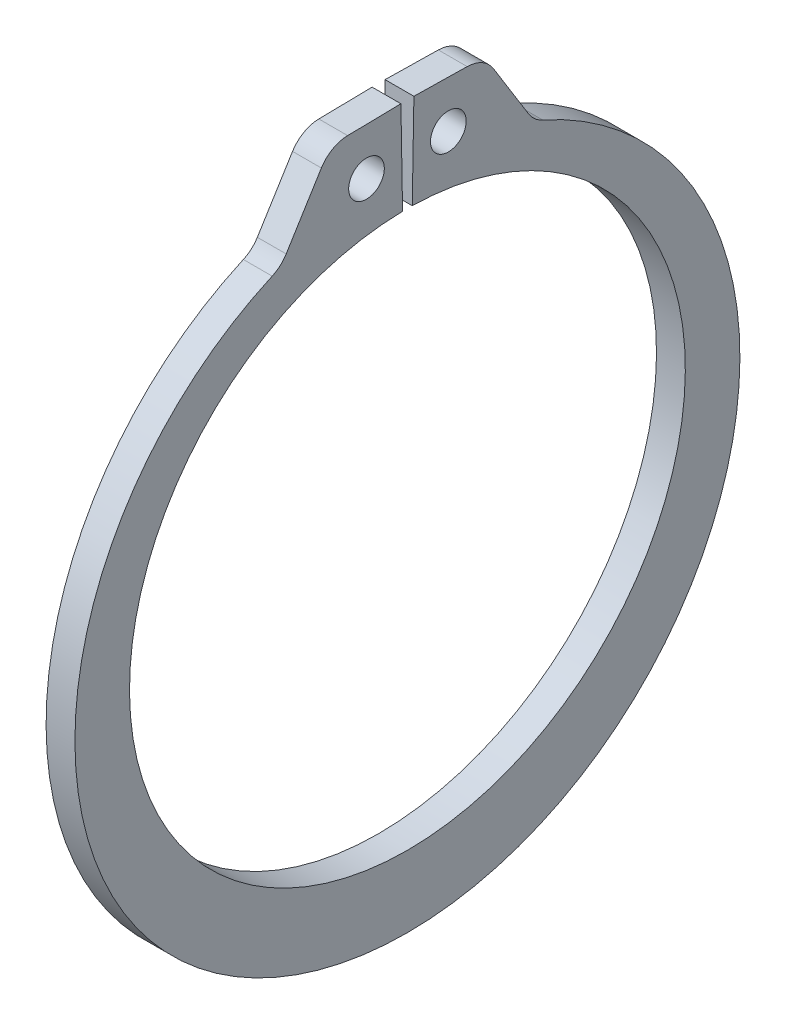
ISO-10303-21;
HEADER;
FILE_DESCRIPTION(('STEP AP214'),'2;1');
FILE_NAME('part.step','',(''),(''),'','','');
FILE_SCHEMA(('AUTOMOTIVE_DESIGN { 1 0 10303 214 1 1 1 1 }'));
ENDSEC;
DATA;
#1=APPLICATION_CONTEXT('core data for automotive mechanical design processes');
#2=APPLICATION_PROTOCOL_DEFINITION('international standard','automotive_design',2000,#1);
#3=PRODUCT_CONTEXT('',#1,'mechanical');
#4=PRODUCT('Part','Part','',(#3));
#5=PRODUCT_RELATED_PRODUCT_CATEGORY('part','',(#4));
#6=PRODUCT_DEFINITION_FORMATION('','',#4);
#7=PRODUCT_DEFINITION_CONTEXT('part definition',#1,'design');
#8=PRODUCT_DEFINITION('design','',#6,#7);
#9=PRODUCT_DEFINITION_SHAPE('','',#8);
#10=(LENGTH_UNIT() NAMED_UNIT(*) SI_UNIT(.MILLI.,.METRE.));
#11=(NAMED_UNIT(*) PLANE_ANGLE_UNIT() SI_UNIT($,.RADIAN.));
#12=(NAMED_UNIT(*) SI_UNIT($,.STERADIAN.) SOLID_ANGLE_UNIT());
#13=UNCERTAINTY_MEASURE_WITH_UNIT(LENGTH_MEASURE(1.E-05),#10,'distance_accuracy_value','');
#14=(GEOMETRIC_REPRESENTATION_CONTEXT(3) GLOBAL_UNCERTAINTY_ASSIGNED_CONTEXT((#13)) GLOBAL_UNIT_ASSIGNED_CONTEXT((#10,
#11,#12)) REPRESENTATION_CONTEXT('',''));
#15=CARTESIAN_POINT('',(0.,0.,0.));
#16=DIRECTION('',(0.,0.,1.));
#17=DIRECTION('',(1.,0.,0.));
#18=AXIS2_PLACEMENT_3D('',#15,#16,#17);
#19=CARTESIAN_POINT('',(0.5334,0.,0.));
#20=DIRECTION('',(1.,0.,0.));
#21=DIRECTION('',(0.,0.,-1.));
#22=AXIS2_PLACEMENT_3D('',#19,#20,#21);
#23=PLANE('',#22);
#24=CARTESIAN_POINT('',(0.5334,12.0022941634062,1.5146246005825));
#25=DIRECTION('',(1.,0.,0.));
#26=DIRECTION('',(0.,0.,-1.));
#27=AXIS2_PLACEMENT_3D('',#24,#25,#26);
#28=CIRCLE('',#27,0.6604);
#29=CARTESIAN_POINT('',(0.5334,12.0022941634062,0.8542246005825));
#30=VERTEX_POINT('',#29);
#31=EDGE_CURVE('E221',#30,#30,#28,.T.);
#32=ORIENTED_EDGE('',*,*,#31,.F.);
#33=EDGE_LOOP('',(#32));
#34=FACE_BOUND('',#33,.T.);
#35=DIRECTION('',(0.,-0.0174524064372796,0.999847695156391));
#36=VECTOR('',#35,1.);
#37=CARTESIAN_POINT('',(0.5334,13.764703249679,0.240263788940795));
#38=LINE('',#37,#36);
#39=CARTESIAN_POINT('',(0.5334,13.764703249679,0.240263788940795));
#40=VERTEX_POINT('',#39);
#41=CARTESIAN_POINT('',(0.5334,13.7302813096865,2.2122954103674));
#42=VERTEX_POINT('',#41);
#43=EDGE_CURVE('E133',#40,#42,#38,.T.);
#44=ORIENTED_EDGE('',*,*,#43,.T.);
#45=CARTESIAN_POINT('',(0.5334,12.5620592626658,2.19190401868609));
#46=DIRECTION('',(1.,0.,0.));
#47=DIRECTION('',(0.,0.,-1.));
#48=AXIS2_PLACEMENT_3D('',#45,#46,#47);
#49=CIRCLE('',#48,1.1684);
#50=CARTESIAN_POINT('',(0.5334,13.1771180937849,3.1853128943573));
#51=VERTEX_POINT('',#50);
#52=EDGE_CURVE('E174',#42,#51,#49,.T.);
#53=ORIENTED_EDGE('',*,*,#52,.T.);
#54=DIRECTION('',(0.,-0.850230122964068,0.526411187195434));
#55=VECTOR('',#54,1.);
#56=CARTESIAN_POINT('',(0.5334,13.7191550867387,2.8497162961447));
#57=LINE('',#56,#55);
#58=CARTESIAN_POINT('',(0.5334,11.0741234414696,4.48736028328253));
#59=VERTEX_POINT('',#58);
#60=EDGE_CURVE('E213',#51,#59,#57,.T.);
#61=ORIENTED_EDGE('',*,*,#60,.T.);
#62=CARTESIAN_POINT('',(0.5334,11.6891822725888,5.48076915895375));
#63=DIRECTION('',(1.,0.,0.));
#64=DIRECTION('',(0.,0.,-1.));
#65=AXIS2_PLACEMENT_3D('',#62,#63,#64);
#66=CIRCLE('',#65,1.1684);
#67=CARTESIAN_POINT('',(0.5334,10.6217868347989,5.00555811174905));
#68=VERTEX_POINT('',#67);
#69=EDGE_CURVE('E181',#59,#68,#66,.F.);
#70=ORIENTED_EDGE('',*,*,#69,.T.);
#71=CARTESIAN_POINT('',(0.5334,-0.621449035876219,0.));
#72=DIRECTION('',(1.,0.,0.));
#73=DIRECTION('',(0.,0.,-1.));
#74=AXIS2_PLACEMENT_3D('',#71,#72,#73);
#75=CIRCLE('',#74,12.3071509641238);
#76=CARTESIAN_POINT('',(0.5334,10.6217868347989,-5.00555811174905));
#77=VERTEX_POINT('',#76);
#78=EDGE_CURVE('E206',#68,#77,#75,.T.);
#79=ORIENTED_EDGE('',*,*,#78,.T.);
#80=CARTESIAN_POINT('',(0.5334,11.6891822725888,-5.48076915895375));
#81=DIRECTION('',(1.,0.,0.));
#82=DIRECTION('',(0.,0.,-1.));
#83=AXIS2_PLACEMENT_3D('',#80,#81,#82);
#84=CIRCLE('',#83,1.1684);
#85=CARTESIAN_POINT('',(0.5334,11.0741234414696,-4.48736028328253));
#86=VERTEX_POINT('',#85);
#87=EDGE_CURVE('E11',#77,#86,#84,.F.);
#88=ORIENTED_EDGE('',*,*,#87,.T.);
#89=DIRECTION('',(0.,0.850230122964068,0.526411187195434));
#90=VECTOR('',#89,1.);
#91=CARTESIAN_POINT('',(0.5334,13.7191550867387,-2.8497162961447));
#92=LINE('',#91,#90);
#93=CARTESIAN_POINT('',(0.5334,13.1771180937849,-3.1853128943573));
#94=VERTEX_POINT('',#93);
#95=EDGE_CURVE('E205',#86,#94,#92,.T.);
#96=ORIENTED_EDGE('',*,*,#95,.T.);
#97=CARTESIAN_POINT('',(0.5334,12.5620592626658,-2.19190401868609));
#98=DIRECTION('',(1.,0.,0.));
#99=DIRECTION('',(0.,0.,-1.));
#100=AXIS2_PLACEMENT_3D('',#97,#98,#99);
#101=CIRCLE('',#100,1.1684);
#102=CARTESIAN_POINT('',(0.5334,13.7302813096865,-2.2122954103674));
#103=VERTEX_POINT('',#102);
#104=EDGE_CURVE('E49',#94,#103,#101,.T.);
#105=ORIENTED_EDGE('',*,*,#104,.T.);
#106=DIRECTION('',(0.,0.0174524064372796,0.999847695156391));
#107=VECTOR('',#106,1.);
#108=CARTESIAN_POINT('',(0.5334,13.764703249679,-0.240263788940795));
#109=LINE('',#108,#107);
#110=CARTESIAN_POINT('',(0.5334,13.764703249679,-0.240263788940795));
#111=VERTEX_POINT('',#110);
#112=EDGE_CURVE('E210',#103,#111,#109,.T.);
#113=ORIENTED_EDGE('',*,*,#112,.T.);
#114=DIRECTION('',(0.,-0.999847695156391,0.0174524064372834));
#115=VECTOR('',#114,1.);
#116=CARTESIAN_POINT('',(0.5334,10.2854332400738,-0.179532905020336));
#117=LINE('',#116,#115);
#118=CARTESIAN_POINT('',(0.5334,10.2854332400738,-0.179532905020336));
#119=VERTEX_POINT('',#118);
#120=EDGE_CURVE('E139',#111,#119,#117,.T.);
#121=ORIENTED_EDGE('',*,*,#120,.T.);
#122=CARTESIAN_POINT('',(0.5334,0.,0.));
#123=DIRECTION('',(-1.,0.,0.));
#124=DIRECTION('',(0.,0.,-1.));
#125=AXIS2_PLACEMENT_3D('',#122,#123,#124);
#126=CIRCLE('',#125,10.287);
#127=CARTESIAN_POINT('',(0.5334,10.2854332400738,0.179532905020336));
#128=VERTEX_POINT('',#127);
#129=EDGE_CURVE('E134',#119,#128,#126,.T.);
#130=ORIENTED_EDGE('',*,*,#129,.T.);
#131=DIRECTION('',(0.,0.999847695156391,0.0174524064372834));
#132=VECTOR('',#131,1.);
#133=CARTESIAN_POINT('',(0.5334,10.2854332400738,0.179532905020336));
#134=LINE('',#133,#132);
#135=EDGE_CURVE('E125',#128,#40,#134,.T.);
#136=ORIENTED_EDGE('',*,*,#135,.T.);
#137=EDGE_LOOP('',(#44,#53,#61,#70,#79,#88,#96,#105,#113,#121,#130,#136));
#138=FACE_BOUND('',#137,.T.);
#139=CARTESIAN_POINT('',(0.5334,12.0022941634062,-1.5146246005825));
#140=DIRECTION('',(1.,0.,0.));
#141=DIRECTION('',(0.,0.,-1.));
#142=AXIS2_PLACEMENT_3D('',#139,#140,#141);
#143=CIRCLE('',#142,0.6604);
#144=CARTESIAN_POINT('',(0.5334,12.0022941634062,-2.1750246005825));
#145=VERTEX_POINT('',#144);
#146=EDGE_CURVE('E247',#145,#145,#143,.T.);
#147=ORIENTED_EDGE('',*,*,#146,.F.);
#148=EDGE_LOOP('',(#147));
#149=FACE_BOUND('',#148,.T.);
#150=ADVANCED_FACE('F34',(#34,#138,#149),#23,.T.);
#151=CARTESIAN_POINT('',(-0.5334,0.,0.));
#152=DIRECTION('',(1.,0.,0.));
#153=DIRECTION('',(0.,0.,-1.));
#154=AXIS2_PLACEMENT_3D('',#151,#152,#153);
#155=PLANE('',#154);
#156=CARTESIAN_POINT('',(-0.5334,12.0022941634062,1.5146246005825));
#157=DIRECTION('',(1.,0.,0.));
#158=DIRECTION('',(0.,0.,-1.));
#159=AXIS2_PLACEMENT_3D('',#156,#157,#158);
#160=CIRCLE('',#159,0.6604);
#161=CARTESIAN_POINT('',(-0.5334,12.0022941634062,0.8542246005825));
#162=VERTEX_POINT('',#161);
#163=EDGE_CURVE('E244',#162,#162,#160,.T.);
#164=ORIENTED_EDGE('',*,*,#163,.T.);
#165=EDGE_LOOP('',(#164));
#166=FACE_BOUND('',#165,.T.);
#167=DIRECTION('',(0.,-0.850230122964068,0.526411187195434));
#168=VECTOR('',#167,1.);
#169=CARTESIAN_POINT('',(-0.5334,13.7191550867387,2.8497162961447));
#170=LINE('',#169,#168);
#171=CARTESIAN_POINT('',(-0.5334,13.1771180937849,3.1853128943573));
#172=VERTEX_POINT('',#171);
#173=CARTESIAN_POINT('',(-0.5334,11.0741234414696,4.48736028328253));
#174=VERTEX_POINT('',#173);
#175=EDGE_CURVE('E200',#172,#174,#170,.T.);
#176=ORIENTED_EDGE('',*,*,#175,.F.);
#177=CARTESIAN_POINT('',(-0.5334,12.5620592626658,2.19190401868609));
#178=DIRECTION('',(1.,0.,0.));
#179=DIRECTION('',(0.,0.,-1.));
#180=AXIS2_PLACEMENT_3D('',#177,#178,#179);
#181=CIRCLE('',#180,1.1684);
#182=CARTESIAN_POINT('',(-0.5334,13.7302813096865,2.2122954103674));
#183=VERTEX_POINT('',#182);
#184=EDGE_CURVE('E170',#172,#183,#181,.F.);
#185=ORIENTED_EDGE('',*,*,#184,.T.);
#186=DIRECTION('',(0.,-0.0174524064372796,0.999847695156391));
#187=VECTOR('',#186,1.);
#188=CARTESIAN_POINT('',(-0.5334,13.764703249679,0.240263788940795));
#189=LINE('',#188,#187);
#190=CARTESIAN_POINT('',(-0.5334,13.764703249679,0.240263788940795));
#191=VERTEX_POINT('',#190);
#192=EDGE_CURVE('E223',#191,#183,#189,.T.);
#193=ORIENTED_EDGE('',*,*,#192,.F.);
#194=DIRECTION('',(0.,0.999847695156391,0.0174524064372834));
#195=VECTOR('',#194,1.);
#196=CARTESIAN_POINT('',(-0.5334,10.2854332400738,0.179532905020336));
#197=LINE('',#196,#195);
#198=CARTESIAN_POINT('',(-0.5334,10.2854332400738,0.179532905020336));
#199=VERTEX_POINT('',#198);
#200=EDGE_CURVE('E220',#199,#191,#197,.T.);
#201=ORIENTED_EDGE('',*,*,#200,.F.);
#202=CARTESIAN_POINT('',(-0.5334,0.,0.));
#203=DIRECTION('',(-1.,0.,0.));
#204=DIRECTION('',(0.,0.,-1.));
#205=AXIS2_PLACEMENT_3D('',#202,#203,#204);
#206=CIRCLE('',#205,10.287);
#207=CARTESIAN_POINT('',(-0.5334,10.2854332400738,-0.179532905020336));
#208=VERTEX_POINT('',#207);
#209=EDGE_CURVE('E147',#208,#199,#206,.T.);
#210=ORIENTED_EDGE('',*,*,#209,.F.);
#211=DIRECTION('',(0.,-0.999847695156391,0.0174524064372834));
#212=VECTOR('',#211,1.);
#213=CARTESIAN_POINT('',(-0.5334,10.2854332400738,-0.179532905020336));
#214=LINE('',#213,#212);
#215=CARTESIAN_POINT('',(-0.5334,13.764703249679,-0.240263788940795));
#216=VERTEX_POINT('',#215);
#217=EDGE_CURVE('E143',#216,#208,#214,.T.);
#218=ORIENTED_EDGE('',*,*,#217,.F.);
#219=DIRECTION('',(0.,0.0174524064372796,0.999847695156391));
#220=VECTOR('',#219,1.);
#221=CARTESIAN_POINT('',(-0.5334,13.764703249679,-0.240263788940795));
#222=LINE('',#221,#220);
#223=CARTESIAN_POINT('',(-0.5334,13.7302813096865,-2.2122954103674));
#224=VERTEX_POINT('',#223);
#225=EDGE_CURVE('E228',#224,#216,#222,.T.);
#226=ORIENTED_EDGE('',*,*,#225,.F.);
#227=CARTESIAN_POINT('',(-0.5334,12.5620592626658,-2.19190401868609));
#228=DIRECTION('',(1.,0.,0.));
#229=DIRECTION('',(0.,0.,-1.));
#230=AXIS2_PLACEMENT_3D('',#227,#228,#229);
#231=CIRCLE('',#230,1.1684);
#232=CARTESIAN_POINT('',(-0.5334,13.1771180937849,-3.1853128943573));
#233=VERTEX_POINT('',#232);
#234=EDGE_CURVE('E168',#224,#233,#231,.F.);
#235=ORIENTED_EDGE('',*,*,#234,.T.);
#236=DIRECTION('',(0.,0.850230122964068,0.526411187195434));
#237=VECTOR('',#236,1.);
#238=CARTESIAN_POINT('',(-0.5334,13.7191550867387,-2.8497162961447));
#239=LINE('',#238,#237);
#240=CARTESIAN_POINT('',(-0.5334,11.0741234414696,-4.48736028328253));
#241=VERTEX_POINT('',#240);
#242=EDGE_CURVE('E191',#241,#233,#239,.T.);
#243=ORIENTED_EDGE('',*,*,#242,.F.);
#244=CARTESIAN_POINT('',(-0.5334,11.6891822725888,-5.48076915895375));
#245=DIRECTION('',(1.,0.,0.));
#246=DIRECTION('',(0.,0.,-1.));
#247=AXIS2_PLACEMENT_3D('',#244,#245,#246);
#248=CIRCLE('',#247,1.1684);
#249=CARTESIAN_POINT('',(-0.5334,10.6217868347989,-5.00555811174905));
#250=VERTEX_POINT('',#249);
#251=EDGE_CURVE('E42',#241,#250,#248,.T.);
#252=ORIENTED_EDGE('',*,*,#251,.T.);
#253=CARTESIAN_POINT('',(-0.5334,-0.621449035876219,0.));
#254=DIRECTION('',(1.,0.,0.));
#255=DIRECTION('',(0.,0.,-1.));
#256=AXIS2_PLACEMENT_3D('',#253,#254,#255);
#257=CIRCLE('',#256,12.3071509641238);
#258=CARTESIAN_POINT('',(-0.5334,10.6217868347989,5.00555811174905));
#259=VERTEX_POINT('',#258);
#260=EDGE_CURVE('E189',#259,#250,#257,.T.);
#261=ORIENTED_EDGE('',*,*,#260,.F.);
#262=CARTESIAN_POINT('',(-0.5334,11.6891822725888,5.48076915895375));
#263=DIRECTION('',(1.,0.,0.));
#264=DIRECTION('',(0.,0.,-1.));
#265=AXIS2_PLACEMENT_3D('',#262,#263,#264);
#266=CIRCLE('',#265,1.1684);
#267=EDGE_CURVE('E179',#259,#174,#266,.T.);
#268=ORIENTED_EDGE('',*,*,#267,.T.);
#269=EDGE_LOOP('',(#176,#185,#193,#201,#210,#218,#226,#235,#243,#252,#261,#268));
#270=FACE_BOUND('',#269,.T.);
#271=CARTESIAN_POINT('',(-0.5334,12.0022941634062,-1.5146246005825));
#272=DIRECTION('',(1.,0.,0.));
#273=DIRECTION('',(0.,0.,-1.));
#274=AXIS2_PLACEMENT_3D('',#271,#272,#273);
#275=CIRCLE('',#274,0.6604);
#276=CARTESIAN_POINT('',(-0.5334,12.0022941634062,-2.1750246005825));
#277=VERTEX_POINT('',#276);
#278=EDGE_CURVE('E250',#277,#277,#275,.T.);
#279=ORIENTED_EDGE('',*,*,#278,.T.);
#280=EDGE_LOOP('',(#279));
#281=FACE_BOUND('',#280,.T.);
#282=ADVANCED_FACE('F187',(#166,#270,#281),#155,.F.);
#283=CARTESIAN_POINT('',(0.5334,0.,0.));
#284=DIRECTION('',(-1.,0.,0.));
#285=DIRECTION('',(0.,0.,1.));
#286=AXIS2_PLACEMENT_3D('',#283,#284,#285);
#287=CYLINDRICAL_SURFACE('',#286,10.287);
#288=ORIENTED_EDGE('',*,*,#209,.T.);
#289=DIRECTION('',(-1.,0.,0.));
#290=VECTOR('',#289,1.);
#291=CARTESIAN_POINT('',(0.5334,10.2854332400738,0.179532905020336));
#292=LINE('',#291,#290);
#293=EDGE_CURVE('E129',#128,#199,#292,.T.);
#294=ORIENTED_EDGE('',*,*,#293,.F.);
#295=ORIENTED_EDGE('',*,*,#129,.F.);
#296=DIRECTION('',(-1.,0.,0.));
#297=VECTOR('',#296,1.);
#298=CARTESIAN_POINT('',(0.5334,10.2854332400738,-0.179532905020336));
#299=LINE('',#298,#297);
#300=EDGE_CURVE('E218',#119,#208,#299,.T.);
#301=ORIENTED_EDGE('',*,*,#300,.T.);
#302=EDGE_LOOP('',(#288,#294,#295,#301));
#303=FACE_BOUND('',#302,.T.);
#304=ADVANCED_FACE('F145',(#303),#287,.F.);
#305=CARTESIAN_POINT('',(0.5334,10.2854332400738,0.179532905020336));
#306=DIRECTION('',(0.,-0.0174524064372834,0.999847695156391));
#307=DIRECTION('',(0.,-0.999847695156391,-0.0174524064372834));
#308=AXIS2_PLACEMENT_3D('',#305,#306,#307);
#309=PLANE('',#308);
#310=ORIENTED_EDGE('',*,*,#200,.T.);
#311=DIRECTION('',(-1.,0.,0.));
#312=VECTOR('',#311,1.);
#313=CARTESIAN_POINT('',(0.5334,13.764703249679,0.240263788940795));
#314=LINE('',#313,#312);
#315=EDGE_CURVE('E132',#40,#191,#314,.T.);
#316=ORIENTED_EDGE('',*,*,#315,.F.);
#317=ORIENTED_EDGE('',*,*,#135,.F.);
#318=ORIENTED_EDGE('',*,*,#293,.T.);
#319=EDGE_LOOP('',(#310,#316,#317,#318));
#320=FACE_BOUND('',#319,.T.);
#321=ADVANCED_FACE('F127',(#320),#309,.F.);
#322=CARTESIAN_POINT('',(0.5334,13.764703249679,0.240263788940795));
#323=DIRECTION('',(0.,-0.999847695156391,-0.0174524064372796));
#324=DIRECTION('',(0.,0.0174524064372796,-0.999847695156391));
#325=AXIS2_PLACEMENT_3D('',#322,#323,#324);
#326=PLANE('',#325);
#327=ORIENTED_EDGE('',*,*,#192,.T.);
#328=DIRECTION('',(-1.,0.,0.));
#329=VECTOR('',#328,1.);
#330=CARTESIAN_POINT('',(0.5334,13.7302813096865,2.2122954103674));
#331=LINE('',#330,#329);
#332=EDGE_CURVE('E57',#183,#42,#331,.F.);
#333=ORIENTED_EDGE('',*,*,#332,.T.);
#334=ORIENTED_EDGE('',*,*,#43,.F.);
#335=ORIENTED_EDGE('',*,*,#315,.T.);
#336=EDGE_LOOP('',(#327,#333,#334,#335));
#337=FACE_BOUND('',#336,.T.);
#338=ADVANCED_FACE('F239',(#337),#326,.F.);
#339=CARTESIAN_POINT('',(0.5334,13.7191550867387,2.8497162961447));
#340=DIRECTION('',(0.,-0.526411187195434,-0.850230122964068));
#341=DIRECTION('',(0.,0.850230122964068,-0.526411187195434));
#342=AXIS2_PLACEMENT_3D('',#339,#340,#341);
#343=PLANE('',#342);
#344=ORIENTED_EDGE('',*,*,#175,.T.);
#345=DIRECTION('',(1.,0.,0.));
#346=VECTOR('',#345,1.);
#347=CARTESIAN_POINT('',(0.5334,11.0741234414696,4.48736028328253));
#348=LINE('',#347,#346);
#349=EDGE_CURVE('E161',#174,#59,#348,.T.);
#350=ORIENTED_EDGE('',*,*,#349,.T.);
#351=ORIENTED_EDGE('',*,*,#60,.F.);
#352=DIRECTION('',(-1.,0.,0.));
#353=VECTOR('',#352,1.);
#354=CARTESIAN_POINT('',(0.5334,13.1771180937849,3.1853128943573));
#355=LINE('',#354,#353);
#356=EDGE_CURVE('E158',#51,#172,#355,.T.);
#357=ORIENTED_EDGE('',*,*,#356,.T.);
#358=EDGE_LOOP('',(#344,#350,#351,#357));
#359=FACE_BOUND('',#358,.T.);
#360=ADVANCED_FACE('F280',(#359),#343,.F.);
#361=CARTESIAN_POINT('',(0.5334,-0.621449035876219,0.));
#362=DIRECTION('',(-1.,0.,0.));
#363=DIRECTION('',(0.,0.,1.));
#364=AXIS2_PLACEMENT_3D('',#361,#362,#363);
#365=CYLINDRICAL_SURFACE('',#364,12.3071509641238);
#366=ORIENTED_EDGE('',*,*,#78,.F.);
#367=DIRECTION('',(-1.,0.,0.));
#368=VECTOR('',#367,1.);
#369=CARTESIAN_POINT('',(0.5334,10.6217868347989,5.00555811174905));
#370=LINE('',#369,#368);
#371=EDGE_CURVE('E150',#68,#259,#370,.T.);
#372=ORIENTED_EDGE('',*,*,#371,.T.);
#373=ORIENTED_EDGE('',*,*,#260,.T.);
#374=DIRECTION('',(-1.,0.,0.));
#375=VECTOR('',#374,1.);
#376=CARTESIAN_POINT('',(0.5334,10.6217868347989,-5.00555811174905));
#377=LINE('',#376,#375);
#378=EDGE_CURVE('E148',#250,#77,#377,.F.);
#379=ORIENTED_EDGE('',*,*,#378,.T.);
#380=EDGE_LOOP('',(#366,#372,#373,#379));
#381=FACE_BOUND('',#380,.T.);
#382=ADVANCED_FACE('F197',(#381),#365,.T.);
#383=CARTESIAN_POINT('',(0.5334,13.7191550867387,-2.8497162961447));
#384=DIRECTION('',(0.,-0.526411187195434,0.850230122964068));
#385=DIRECTION('',(0.,-0.850230122964068,-0.526411187195434));
#386=AXIS2_PLACEMENT_3D('',#383,#384,#385);
#387=PLANE('',#386);
#388=ORIENTED_EDGE('',*,*,#95,.F.);
#389=DIRECTION('',(1.,0.,0.));
#390=VECTOR('',#389,1.);
#391=CARTESIAN_POINT('',(-0.5334,11.0741234414696,-4.48736028328253));
#392=LINE('',#391,#390);
#393=EDGE_CURVE('E165',#86,#241,#392,.F.);
#394=ORIENTED_EDGE('',*,*,#393,.T.);
#395=ORIENTED_EDGE('',*,*,#242,.T.);
#396=DIRECTION('',(-1.,0.,0.));
#397=VECTOR('',#396,1.);
#398=CARTESIAN_POINT('',(0.5334,13.1771180937849,-3.1853128943573));
#399=LINE('',#398,#397);
#400=EDGE_CURVE('E163',#233,#94,#399,.F.);
#401=ORIENTED_EDGE('',*,*,#400,.T.);
#402=EDGE_LOOP('',(#388,#394,#395,#401));
#403=FACE_BOUND('',#402,.T.);
#404=ADVANCED_FACE('F208',(#403),#387,.F.);
#405=CARTESIAN_POINT('',(0.5334,13.764703249679,-0.240263788940795));
#406=DIRECTION('',(0.,-0.999847695156391,0.0174524064372796));
#407=DIRECTION('',(0.,-0.0174524064372796,-0.999847695156391));
#408=AXIS2_PLACEMENT_3D('',#405,#406,#407);
#409=PLANE('',#408);
#410=ORIENTED_EDGE('',*,*,#112,.F.);
#411=DIRECTION('',(-1.,0.,0.));
#412=VECTOR('',#411,1.);
#413=CARTESIAN_POINT('',(0.5334,13.7302813096865,-2.2122954103674));
#414=LINE('',#413,#412);
#415=EDGE_CURVE('E176',#103,#224,#414,.T.);
#416=ORIENTED_EDGE('',*,*,#415,.T.);
#417=ORIENTED_EDGE('',*,*,#225,.T.);
#418=DIRECTION('',(-1.,0.,0.));
#419=VECTOR('',#418,1.);
#420=CARTESIAN_POINT('',(0.5334,13.764703249679,-0.240263788940795));
#421=LINE('',#420,#419);
#422=EDGE_CURVE('E152',#111,#216,#421,.T.);
#423=ORIENTED_EDGE('',*,*,#422,.F.);
#424=EDGE_LOOP('',(#410,#416,#417,#423));
#425=FACE_BOUND('',#424,.T.);
#426=ADVANCED_FACE('F273',(#425),#409,.F.);
#427=CARTESIAN_POINT('',(0.5334,10.2854332400738,-0.179532905020336));
#428=DIRECTION('',(0.,-0.0174524064372834,-0.999847695156391));
#429=DIRECTION('',(0.,0.999847695156391,-0.0174524064372834));
#430=AXIS2_PLACEMENT_3D('',#427,#428,#429);
#431=PLANE('',#430);
#432=ORIENTED_EDGE('',*,*,#217,.T.);
#433=ORIENTED_EDGE('',*,*,#300,.F.);
#434=ORIENTED_EDGE('',*,*,#120,.F.);
#435=ORIENTED_EDGE('',*,*,#422,.T.);
#436=EDGE_LOOP('',(#432,#433,#434,#435));
#437=FACE_BOUND('',#436,.T.);
#438=ADVANCED_FACE('F235',(#437),#431,.F.);
#439=CARTESIAN_POINT('',(0.5334,12.0022941634062,1.5146246005825));
#440=DIRECTION('',(-1.,0.,0.));
#441=DIRECTION('',(0.,0.,1.));
#442=AXIS2_PLACEMENT_3D('',#439,#440,#441);
#443=CYLINDRICAL_SURFACE('',#442,0.6604);
#444=ORIENTED_EDGE('',*,*,#31,.T.);
#445=EDGE_LOOP('',(#444));
#446=FACE_BOUND('',#445,.T.);
#447=ORIENTED_EDGE('',*,*,#163,.F.);
#448=EDGE_LOOP('',(#447));
#449=FACE_BOUND('',#448,.T.);
#450=ADVANCED_FACE('F268',(#446,#449),#443,.F.);
#451=CARTESIAN_POINT('',(0.5334,12.0022941634062,-1.5146246005825));
#452=DIRECTION('',(-1.,0.,0.));
#453=DIRECTION('',(0.,0.,1.));
#454=AXIS2_PLACEMENT_3D('',#451,#452,#453);
#455=CYLINDRICAL_SURFACE('',#454,0.6604);
#456=ORIENTED_EDGE('',*,*,#146,.T.);
#457=EDGE_LOOP('',(#456));
#458=FACE_BOUND('',#457,.T.);
#459=ORIENTED_EDGE('',*,*,#278,.F.);
#460=EDGE_LOOP('',(#459));
#461=FACE_BOUND('',#460,.T.);
#462=ADVANCED_FACE('F256',(#458,#461),#455,.F.);
#463=CARTESIAN_POINT('',(0.5334,11.6891822725888,5.48076915895375));
#464=DIRECTION('',(-1.,0.,0.));
#465=DIRECTION('',(0.,0.,1.));
#466=AXIS2_PLACEMENT_3D('',#463,#464,#465);
#467=CYLINDRICAL_SURFACE('',#466,1.1684);
#468=ORIENTED_EDGE('',*,*,#69,.F.);
#469=ORIENTED_EDGE('',*,*,#349,.F.);
#470=ORIENTED_EDGE('',*,*,#267,.F.);
#471=ORIENTED_EDGE('',*,*,#371,.F.);
#472=EDGE_LOOP('',(#468,#469,#470,#471));
#473=FACE_BOUND('',#472,.T.);
#474=ADVANCED_FACE('F290',(#473),#467,.F.);
#475=CARTESIAN_POINT('',(0.5334,11.6891822725888,-5.48076915895375));
#476=DIRECTION('',(-1.,0.,0.));
#477=DIRECTION('',(0.,0.,1.));
#478=AXIS2_PLACEMENT_3D('',#475,#476,#477);
#479=CYLINDRICAL_SURFACE('',#478,1.1684);
#480=ORIENTED_EDGE('',*,*,#87,.F.);
#481=ORIENTED_EDGE('',*,*,#378,.F.);
#482=ORIENTED_EDGE('',*,*,#251,.F.);
#483=ORIENTED_EDGE('',*,*,#393,.F.);
#484=EDGE_LOOP('',(#480,#481,#482,#483));
#485=FACE_BOUND('',#484,.T.);
#486=ADVANCED_FACE('F203',(#485),#479,.F.);
#487=CARTESIAN_POINT('',(0.5334,12.5620592626658,2.19190401868609));
#488=DIRECTION('',(-1.,0.,0.));
#489=DIRECTION('',(0.,0.,1.));
#490=AXIS2_PLACEMENT_3D('',#487,#488,#489);
#491=CYLINDRICAL_SURFACE('',#490,1.1684);
#492=ORIENTED_EDGE('',*,*,#52,.F.);
#493=ORIENTED_EDGE('',*,*,#332,.F.);
#494=ORIENTED_EDGE('',*,*,#184,.F.);
#495=ORIENTED_EDGE('',*,*,#356,.F.);
#496=EDGE_LOOP('',(#492,#493,#494,#495));
#497=FACE_BOUND('',#496,.T.);
#498=ADVANCED_FACE('F295',(#497),#491,.T.);
#499=CARTESIAN_POINT('',(0.5334,12.5620592626658,-2.19190401868609));
#500=DIRECTION('',(-1.,0.,0.));
#501=DIRECTION('',(0.,0.,1.));
#502=AXIS2_PLACEMENT_3D('',#499,#500,#501);
#503=CYLINDRICAL_SURFACE('',#502,1.1684);
#504=ORIENTED_EDGE('',*,*,#104,.F.);
#505=ORIENTED_EDGE('',*,*,#400,.F.);
#506=ORIENTED_EDGE('',*,*,#234,.F.);
#507=ORIENTED_EDGE('',*,*,#415,.F.);
#508=EDGE_LOOP('',(#504,#505,#506,#507));
#509=FACE_BOUND('',#508,.T.);
#510=ADVANCED_FACE('F36',(#509),#503,.T.);
#511=CLOSED_SHELL('',(#150,#282,#304,#321,#338,#360,#382,#404,#426,#438,#450,#462,#474,#486,
#498,#510));
#512=MANIFOLD_SOLID_BREP('B2',#511);
#513=ADVANCED_BREP_SHAPE_REPRESENTATION('',(#18,#512),#14);
#514=SHAPE_DEFINITION_REPRESENTATION(#9,#513);
ENDSEC;
END-ISO-10303-21;
